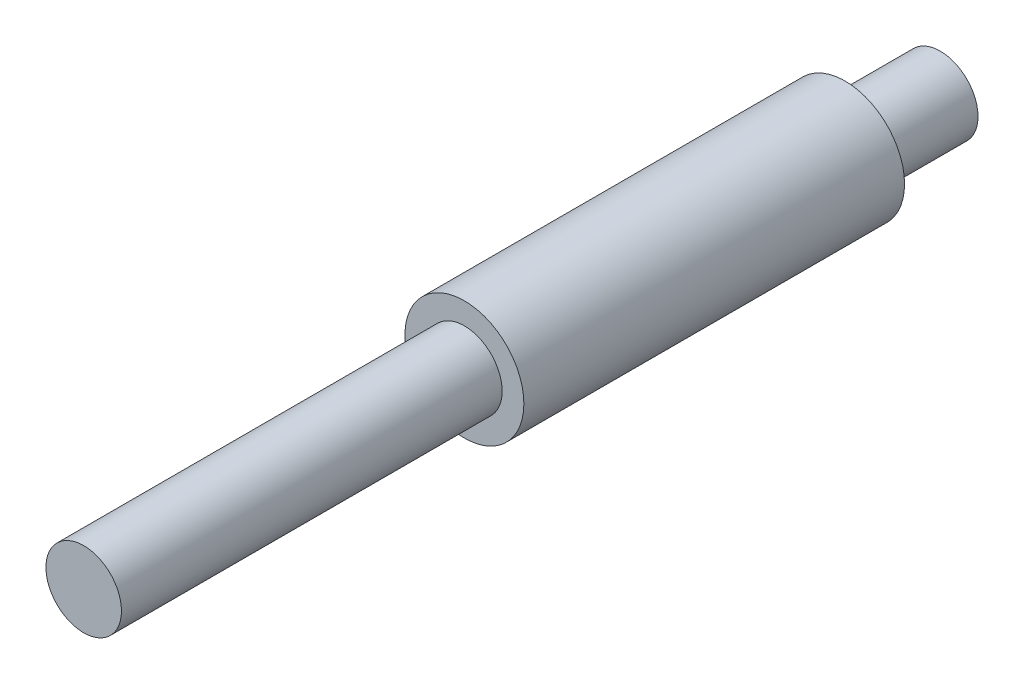
ISO-10303-21;
HEADER;
FILE_DESCRIPTION(('STEP AP214'),'2;1');
FILE_NAME('part.step','',(''),(''),'','','');
FILE_SCHEMA(('AUTOMOTIVE_DESIGN { 1 0 10303 214 1 1 1 1 }'));
ENDSEC;
DATA;
#1=APPLICATION_CONTEXT('core data for automotive mechanical design processes');
#2=APPLICATION_PROTOCOL_DEFINITION('international standard','automotive_design',2000,#1);
#3=PRODUCT_CONTEXT('',#1,'mechanical');
#4=PRODUCT('Part','Part','',(#3));
#5=PRODUCT_RELATED_PRODUCT_CATEGORY('part','',(#4));
#6=PRODUCT_DEFINITION_FORMATION('','',#4);
#7=PRODUCT_DEFINITION_CONTEXT('part definition',#1,'design');
#8=PRODUCT_DEFINITION('design','',#6,#7);
#9=PRODUCT_DEFINITION_SHAPE('','',#8);
#10=(LENGTH_UNIT() NAMED_UNIT(*) SI_UNIT(.MILLI.,.METRE.));
#11=(NAMED_UNIT(*) PLANE_ANGLE_UNIT() SI_UNIT($,.RADIAN.));
#12=(NAMED_UNIT(*) SI_UNIT($,.STERADIAN.) SOLID_ANGLE_UNIT());
#13=UNCERTAINTY_MEASURE_WITH_UNIT(LENGTH_MEASURE(1.E-05),#10,'distance_accuracy_value','');
#14=(GEOMETRIC_REPRESENTATION_CONTEXT(3) GLOBAL_UNCERTAINTY_ASSIGNED_CONTEXT((#13)) GLOBAL_UNIT_ASSIGNED_CONTEXT((#10,
#11,#12)) REPRESENTATION_CONTEXT('',''));
#15=CARTESIAN_POINT('',(0.,0.,0.));
#16=DIRECTION('',(0.,0.,1.));
#17=DIRECTION('',(1.,0.,0.));
#18=AXIS2_PLACEMENT_3D('',#15,#16,#17);
#19=CARTESIAN_POINT('',(0.,0.,16.));
#20=DIRECTION('',(0.,0.,-1.));
#21=DIRECTION('',(-1.,0.,0.));
#22=AXIS2_PLACEMENT_3D('',#19,#20,#21);
#23=CYLINDRICAL_SURFACE('',#22,2.5);
#24=CARTESIAN_POINT('',(0.,0.,16.));
#25=DIRECTION('',(0.,0.,1.));
#26=DIRECTION('',(1.,0.,0.));
#27=AXIS2_PLACEMENT_3D('',#24,#25,#26);
#28=CIRCLE('',#27,2.5);
#29=CARTESIAN_POINT('',(2.5,0.,16.));
#30=VERTEX_POINT('',#29);
#31=EDGE_CURVE('E36',#30,#30,#28,.T.);
#32=ORIENTED_EDGE('',*,*,#31,.F.);
#33=EDGE_LOOP('',(#32));
#34=FACE_BOUND('',#33,.T.);
#35=CARTESIAN_POINT('',(0.,0.,0.));
#36=DIRECTION('',(0.,0.,1.));
#37=DIRECTION('',(1.,0.,0.));
#38=AXIS2_PLACEMENT_3D('',#35,#36,#37);
#39=CIRCLE('',#38,2.5);
#40=CARTESIAN_POINT('',(2.5,0.,0.));
#41=VERTEX_POINT('',#40);
#42=EDGE_CURVE('E41',#41,#41,#39,.T.);
#43=ORIENTED_EDGE('',*,*,#42,.T.);
#44=EDGE_LOOP('',(#43));
#45=FACE_BOUND('',#44,.T.);
#46=ADVANCED_FACE('F29',(#34,#45),#23,.T.);
#47=CARTESIAN_POINT('',(0.,0.,16.));
#48=DIRECTION('',(0.,0.,1.));
#49=DIRECTION('',(1.,0.,0.));
#50=AXIS2_PLACEMENT_3D('',#47,#48,#49);
#51=PLANE('',#50);
#52=CARTESIAN_POINT('',(0.,0.,16.));
#53=DIRECTION('',(0.,0.,1.));
#54=DIRECTION('',(1.,0.,0.));
#55=AXIS2_PLACEMENT_3D('',#52,#53,#54);
#56=CIRCLE('',#55,1.5875);
#57=CARTESIAN_POINT('',(1.5875,0.,16.));
#58=VERTEX_POINT('',#57);
#59=EDGE_CURVE('E10',#58,#58,#56,.T.);
#60=ORIENTED_EDGE('',*,*,#59,.F.);
#61=EDGE_LOOP('',(#60));
#62=FACE_BOUND('',#61,.T.);
#63=ORIENTED_EDGE('',*,*,#31,.T.);
#64=EDGE_LOOP('',(#63));
#65=FACE_BOUND('',#64,.T.);
#66=ADVANCED_FACE('F74',(#62,#65),#51,.T.);
#67=CARTESIAN_POINT('',(0.,0.,0.));
#68=DIRECTION('',(0.,0.,1.));
#69=DIRECTION('',(1.,0.,0.));
#70=AXIS2_PLACEMENT_3D('',#67,#68,#69);
#71=PLANE('',#70);
#72=CARTESIAN_POINT('',(0.,0.,0.));
#73=DIRECTION('',(0.,0.,1.));
#74=DIRECTION('',(1.,0.,0.));
#75=AXIS2_PLACEMENT_3D('',#72,#73,#74);
#76=CIRCLE('',#75,1.5875);
#77=CARTESIAN_POINT('',(1.5875,0.,0.));
#78=VERTEX_POINT('',#77);
#79=EDGE_CURVE('E32',#78,#78,#76,.T.);
#80=ORIENTED_EDGE('',*,*,#79,.T.);
#81=EDGE_LOOP('',(#80));
#82=FACE_BOUND('',#81,.T.);
#83=ORIENTED_EDGE('',*,*,#42,.F.);
#84=EDGE_LOOP('',(#83));
#85=FACE_BOUND('',#84,.T.);
#86=ADVANCED_FACE('F79',(#82,#85),#71,.F.);
#87=CARTESIAN_POINT('',(0.,0.,-4.));
#88=DIRECTION('',(0.,0.,1.));
#89=DIRECTION('',(1.,0.,0.));
#90=AXIS2_PLACEMENT_3D('',#87,#88,#89);
#91=PLANE('',#90);
#92=CARTESIAN_POINT('',(0.,0.,-4.));
#93=DIRECTION('',(0.,0.,1.));
#94=DIRECTION('',(1.,0.,0.));
#95=AXIS2_PLACEMENT_3D('',#92,#93,#94);
#96=CIRCLE('',#95,1.5875);
#97=CARTESIAN_POINT('',(1.5875,0.,-4.));
#98=VERTEX_POINT('',#97);
#99=EDGE_CURVE('E44',#98,#98,#96,.T.);
#100=ORIENTED_EDGE('',*,*,#99,.F.);
#101=EDGE_LOOP('',(#100));
#102=FACE_BOUND('',#101,.T.);
#103=ADVANCED_FACE('F70',(#102),#91,.F.);
#104=CARTESIAN_POINT('',(0.,0.,-4.));
#105=DIRECTION('',(0.,0.,1.));
#106=DIRECTION('',(1.,0.,0.));
#107=AXIS2_PLACEMENT_3D('',#104,#105,#106);
#108=CYLINDRICAL_SURFACE('',#107,1.5875);
#109=ORIENTED_EDGE('',*,*,#99,.T.);
#110=EDGE_LOOP('',(#109));
#111=FACE_BOUND('',#110,.T.);
#112=ORIENTED_EDGE('',*,*,#79,.F.);
#113=EDGE_LOOP('',(#112));
#114=FACE_BOUND('',#113,.T.);
#115=ADVANCED_FACE('F63',(#111,#114),#108,.T.);
#116=ORIENTED_EDGE('',*,*,#59,.T.);
#117=EDGE_LOOP('',(#116));
#118=FACE_BOUND('',#117,.T.);
#119=CARTESIAN_POINT('',(0.,0.,32.));
#120=DIRECTION('',(0.,0.,1.));
#121=DIRECTION('',(1.,0.,0.));
#122=AXIS2_PLACEMENT_3D('',#119,#120,#121);
#123=CIRCLE('',#122,1.5875);
#124=CARTESIAN_POINT('',(1.5875,0.,32.));
#125=VERTEX_POINT('',#124);
#126=EDGE_CURVE('E53',#125,#125,#123,.T.);
#127=ORIENTED_EDGE('',*,*,#126,.F.);
#128=EDGE_LOOP('',(#127));
#129=FACE_BOUND('',#128,.T.);
#130=ADVANCED_FACE('F61',(#118,#129),#108,.T.);
#131=CARTESIAN_POINT('',(0.,0.,32.));
#132=DIRECTION('',(0.,0.,1.));
#133=DIRECTION('',(1.,0.,0.));
#134=AXIS2_PLACEMENT_3D('',#131,#132,#133);
#135=PLANE('',#134);
#136=ORIENTED_EDGE('',*,*,#126,.T.);
#137=EDGE_LOOP('',(#136));
#138=FACE_BOUND('',#137,.T.);
#139=ADVANCED_FACE('F59',(#138),#135,.T.);
#140=CLOSED_SHELL('',(#46,#66,#86,#103,#115,#130,#139));
#141=MANIFOLD_SOLID_BREP('B2',#140);
#142=ADVANCED_BREP_SHAPE_REPRESENTATION('',(#18,#141),#14);
#143=SHAPE_DEFINITION_REPRESENTATION(#9,#142);
ENDSEC;
END-ISO-10303-21;
